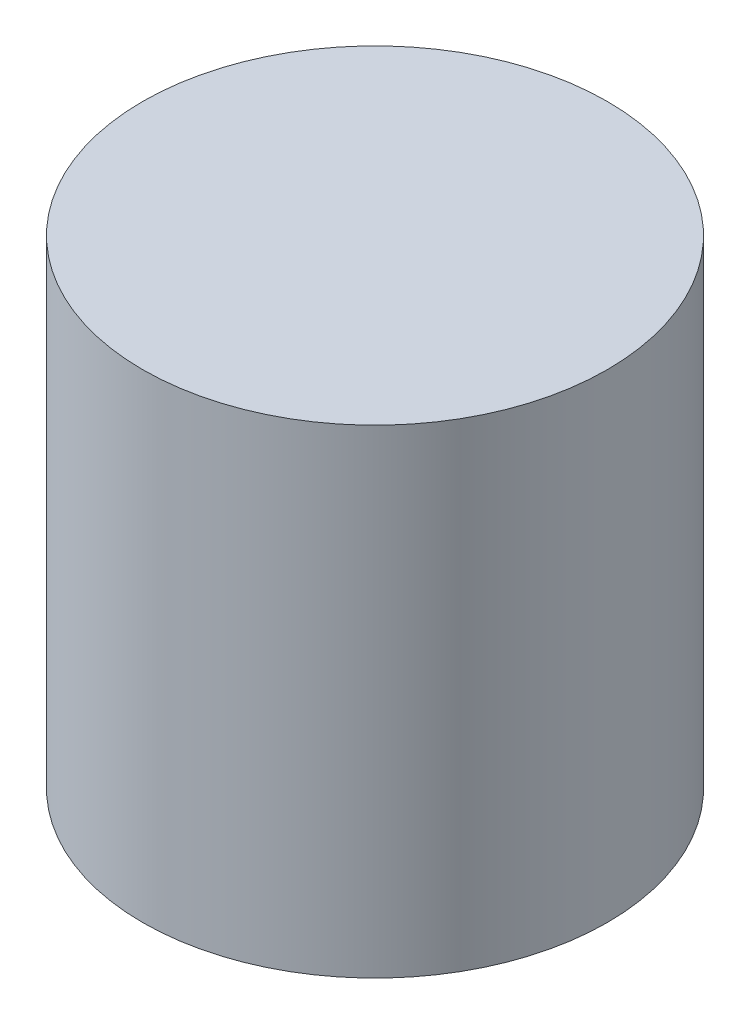
ISO-10303-21;
HEADER;
FILE_DESCRIPTION(('STEP AP214'),'2;1');
FILE_NAME('part.step','',(''),(''),'','','');
FILE_SCHEMA(('AUTOMOTIVE_DESIGN { 1 0 10303 214 1 1 1 1 }'));
ENDSEC;
DATA;
#1=APPLICATION_CONTEXT('core data for automotive mechanical design processes');
#2=APPLICATION_PROTOCOL_DEFINITION('international standard','automotive_design',2000,#1);
#3=PRODUCT_CONTEXT('',#1,'mechanical');
#4=PRODUCT('Part','Part','',(#3));
#5=PRODUCT_RELATED_PRODUCT_CATEGORY('part','',(#4));
#6=PRODUCT_DEFINITION_FORMATION('','',#4);
#7=PRODUCT_DEFINITION_CONTEXT('part definition',#1,'design');
#8=PRODUCT_DEFINITION('design','',#6,#7);
#9=PRODUCT_DEFINITION_SHAPE('','',#8);
#10=(LENGTH_UNIT() NAMED_UNIT(*) SI_UNIT(.MILLI.,.METRE.));
#11=(NAMED_UNIT(*) PLANE_ANGLE_UNIT() SI_UNIT($,.RADIAN.));
#12=(NAMED_UNIT(*) SI_UNIT($,.STERADIAN.) SOLID_ANGLE_UNIT());
#13=UNCERTAINTY_MEASURE_WITH_UNIT(LENGTH_MEASURE(1.E-05),#10,'distance_accuracy_value','');
#14=(GEOMETRIC_REPRESENTATION_CONTEXT(3) GLOBAL_UNCERTAINTY_ASSIGNED_CONTEXT((#13)) GLOBAL_UNIT_ASSIGNED_CONTEXT((#10,
#11,#12)) REPRESENTATION_CONTEXT('',''));
#15=CARTESIAN_POINT('',(0.,0.,0.));
#16=DIRECTION('',(0.,0.,1.));
#17=DIRECTION('',(1.,0.,0.));
#18=AXIS2_PLACEMENT_3D('',#15,#16,#17);
#19=CARTESIAN_POINT('',(-287.174494692058,53.25,-235.));
#20=DIRECTION('',(0.,-1.,0.));
#21=DIRECTION('',(0.,0.,-1.));
#22=AXIS2_PLACEMENT_3D('',#19,#20,#21);
#23=CYLINDRICAL_SURFACE('',#22,49.0000000000004);
#24=CARTESIAN_POINT('',(-287.174494692058,53.25,-235.));
#25=DIRECTION('',(0.,-1.,0.));
#26=DIRECTION('',(0.,0.,-1.));
#27=AXIS2_PLACEMENT_3D('',#24,#25,#26);
#28=CIRCLE('',#27,49.0000000000004);
#29=CARTESIAN_POINT('',(-287.174494692058,53.25,-284.));
#30=VERTEX_POINT('',#29);
#31=EDGE_CURVE('E10',#30,#30,#28,.T.);
#32=ORIENTED_EDGE('',*,*,#31,.T.);
#33=EDGE_LOOP('',(#32));
#34=FACE_BOUND('',#33,.T.);
#35=CARTESIAN_POINT('',(-287.174494692058,-47.75,-235.));
#36=DIRECTION('',(0.,-1.,0.));
#37=DIRECTION('',(0.,0.,-1.));
#38=AXIS2_PLACEMENT_3D('',#35,#36,#37);
#39=CIRCLE('',#38,49.0000000000004);
#40=CARTESIAN_POINT('',(-287.174494692058,-47.75,-284.));
#41=VERTEX_POINT('',#40);
#42=EDGE_CURVE('E34',#41,#41,#39,.T.);
#43=ORIENTED_EDGE('',*,*,#42,.F.);
#44=EDGE_LOOP('',(#43));
#45=FACE_BOUND('',#44,.T.);
#46=ADVANCED_FACE('F31',(#34,#45),#23,.T.);
#47=CARTESIAN_POINT('',(-287.174494692058,53.25,-235.));
#48=DIRECTION('',(0.,-1.,0.));
#49=DIRECTION('',(0.,0.,-1.));
#50=AXIS2_PLACEMENT_3D('',#47,#48,#49);
#51=PLANE('',#50);
#52=ORIENTED_EDGE('',*,*,#31,.F.);
#53=EDGE_LOOP('',(#52));
#54=FACE_BOUND('',#53,.T.);
#55=ADVANCED_FACE('F46',(#54),#51,.F.);
#56=CARTESIAN_POINT('',(-287.174494692058,-47.75,-235.));
#57=DIRECTION('',(0.,-1.,0.));
#58=DIRECTION('',(0.,0.,-1.));
#59=AXIS2_PLACEMENT_3D('',#56,#57,#58);
#60=PLANE('',#59);
#61=ORIENTED_EDGE('',*,*,#42,.T.);
#62=EDGE_LOOP('',(#61));
#63=FACE_BOUND('',#62,.T.);
#64=ADVANCED_FACE('F43',(#63),#60,.T.);
#65=CLOSED_SHELL('',(#46,#55,#64));
#66=MANIFOLD_SOLID_BREP('B2',#65);
#67=ADVANCED_BREP_SHAPE_REPRESENTATION('',(#18,#66),#14);
#68=SHAPE_DEFINITION_REPRESENTATION(#9,#67);
ENDSEC;
END-ISO-10303-21;
